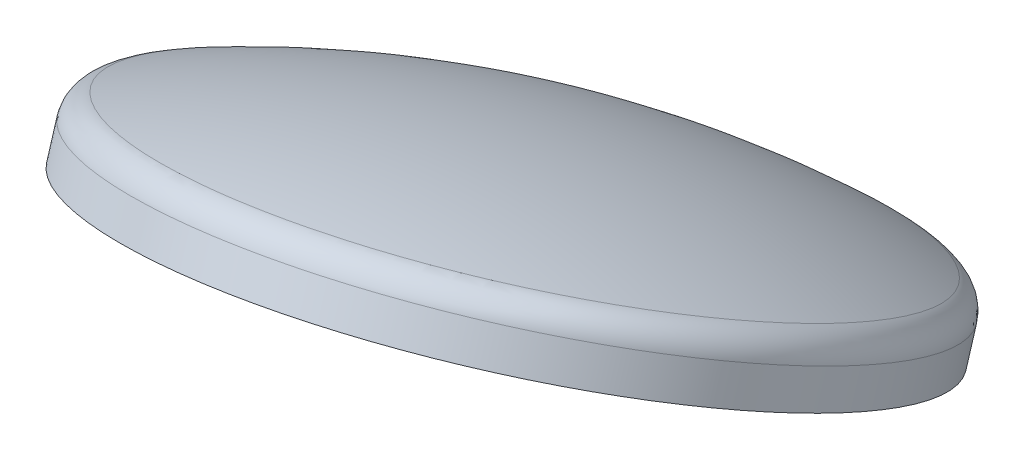
ISO-10303-21;
HEADER;
FILE_DESCRIPTION(('STEP AP214'),'2;1');
FILE_NAME('part.step','',(''),(''),'','','');
FILE_SCHEMA(('AUTOMOTIVE_DESIGN { 1 0 10303 214 1 1 1 1 }'));
ENDSEC;
DATA;
#1=APPLICATION_CONTEXT('core data for automotive mechanical design processes');
#2=APPLICATION_PROTOCOL_DEFINITION('international standard','automotive_design',2000,#1);
#3=PRODUCT_CONTEXT('',#1,'mechanical');
#4=PRODUCT('Part','Part','',(#3));
#5=PRODUCT_RELATED_PRODUCT_CATEGORY('part','',(#4));
#6=PRODUCT_DEFINITION_FORMATION('','',#4);
#7=PRODUCT_DEFINITION_CONTEXT('part definition',#1,'design');
#8=PRODUCT_DEFINITION('design','',#6,#7);
#9=PRODUCT_DEFINITION_SHAPE('','',#8);
#10=(LENGTH_UNIT() NAMED_UNIT(*) SI_UNIT(.MILLI.,.METRE.));
#11=(NAMED_UNIT(*) PLANE_ANGLE_UNIT() SI_UNIT($,.RADIAN.));
#12=(NAMED_UNIT(*) SI_UNIT($,.STERADIAN.) SOLID_ANGLE_UNIT());
#13=UNCERTAINTY_MEASURE_WITH_UNIT(LENGTH_MEASURE(1.E-05),#10,'distance_accuracy_value','');
#14=(GEOMETRIC_REPRESENTATION_CONTEXT(3) GLOBAL_UNCERTAINTY_ASSIGNED_CONTEXT((#13)) GLOBAL_UNIT_ASSIGNED_CONTEXT((#10,
#11,#12)) REPRESENTATION_CONTEXT('',''));
#15=CARTESIAN_POINT('',(0.,0.,0.));
#16=DIRECTION('',(0.,0.,1.));
#17=DIRECTION('',(1.,0.,0.));
#18=AXIS2_PLACEMENT_3D('',#15,#16,#17);
#19=CARTESIAN_POINT('',(-243.694534553083,114.821215464031,169.928663378537));
#20=DIRECTION('',(-0.106421938285636,0.905813628156302,-0.410092723780666));
#21=DIRECTION('',(0.,0.412434916783466,0.910987068743468));
#22=AXIS2_PLACEMENT_3D('',#19,#20,#21);
#23=PLANE('',#22);
#24=CARTESIAN_POINT('',(-215.087873043626,23.3383331040168,-39.5625393875644));
#25=DIRECTION('',(-0.106421938285636,0.905813628156302,-0.410092723780666));
#26=DIRECTION('',(0.,0.412434916783466,0.910987068743468));
#27=AXIS2_PLACEMENT_3D('',#24,#25,#26);
#28=CIRCLE('',#27,233.553000000001);
#29=CARTESIAN_POINT('',(-215.087873043626,119.663745223546,173.20122347868));
#30=VERTEX_POINT('',#29);
#31=EDGE_CURVE('E55',#30,#30,#28,.T.);
#32=ORIENTED_EDGE('',*,*,#31,.F.);
#33=EDGE_LOOP('',(#32));
#34=FACE_BOUND('',#33,.T.);
#35=CARTESIAN_POINT('',(-215.087873043626,23.3383331040168,-39.5625393875643));
#36=DIRECTION('',(-0.106421938285636,0.905813628156302,-0.410092723780666));
#37=DIRECTION('',(0.,0.412434916783466,0.910987068743468));
#38=AXIS2_PLACEMENT_3D('',#35,#36,#37);
#39=CIRCLE('',#38,230.378000000002);
#40=CARTESIAN_POINT('',(-215.087873043626,118.354264362759,170.30883953542));
#41=VERTEX_POINT('',#40);
#42=EDGE_CURVE('E10',#41,#41,#39,.T.);
#43=ORIENTED_EDGE('',*,*,#42,.T.);
#44=EDGE_LOOP('',(#43));
#45=FACE_BOUND('',#44,.T.);
#46=ADVANCED_FACE('F33',(#34,#45),#23,.F.);
#47=CARTESIAN_POINT('',(-223.535114395048,95.2372898389191,-72.1136493376528));
#48=DIRECTION('',(-0.106421938285636,0.905813628156302,-0.410092723780666));
#49=DIRECTION('',(0.,0.412434916783466,0.910987068743468));
#50=AXIS2_PLACEMENT_3D('',#47,#48,#49);
#51=CYLINDRICAL_SURFACE('',#50,230.378000000001);
#52=ORIENTED_EDGE('',*,*,#42,.F.);
#53=EDGE_LOOP('',(#52));
#54=FACE_BOUND('',#53,.T.);
#55=CARTESIAN_POINT('',(-217.463781122888,43.5609484041285,-48.7180070606124));
#56=DIRECTION('',(-0.106421938285636,0.905813628156302,-0.410092723780666));
#57=DIRECTION('',(0.,0.412434916783466,0.910987068743468));
#58=AXIS2_PLACEMENT_3D('',#55,#56,#57);
#59=CIRCLE('',#58,230.378000000001);
#60=CARTESIAN_POINT('',(-217.463781122888,138.57687966287,161.153371862371));
#61=VERTEX_POINT('',#60);
#62=EDGE_CURVE('E39',#61,#61,#59,.T.);
#63=ORIENTED_EDGE('',*,*,#62,.T.);
#64=EDGE_LOOP('',(#63));
#65=FACE_BOUND('',#64,.T.);
#66=ADVANCED_FACE('F62',(#54,#65),#51,.F.);
#67=CARTESIAN_POINT('',(-217.463781122888,43.5609484041281,-48.7180070606122));
#68=DIRECTION('',(-0.106421938285636,0.905813628156302,-0.410092723780666));
#69=DIRECTION('',(0.,0.412434916783466,0.910987068743468));
#70=AXIS2_PLACEMENT_3D('',#67,#68,#69);
#71=TOROIDAL_SURFACE('',#70,211.328000000001,19.05);
#72=ORIENTED_EDGE('',*,*,#62,.F.);
#73=EDGE_LOOP('',(#72));
#74=FACE_BOUND('',#73,.T.);
#75=CARTESIAN_POINT('',(-219.383922920314,59.9042948618149,-56.1171974196331));
#76=DIRECTION('',(-0.106421938285636,0.905813628156302,-0.410092723780666));
#77=DIRECTION('',(0.,0.412434916783466,0.910987068743468));
#78=AXIS2_PLACEMENT_3D('',#75,#76,#77);
#79=CIRCLE('',#78,217.440492459937);
#80=CARTESIAN_POINT('',(-219.383922920314,149.584346274885,141.968279432581));
#81=VERTEX_POINT('',#80);
#82=EDGE_CURVE('E43',#81,#81,#79,.T.);
#83=ORIENTED_EDGE('',*,*,#82,.T.);
#84=EDGE_LOOP('',(#83));
#85=FACE_BOUND('',#84,.T.);
#86=ADVANCED_FACE('F66',(#74,#85),#71,.F.);
#87=CARTESIAN_POINT('',(-151.078468024181,-521.4797028274,207.095167424291));
#88=DIRECTION('',(-0.106421938285636,0.905813628156302,-0.410092723780666));
#89=DIRECTION('',(0.124172714015471,-0.397099038797168,-0.909336841044284));
#90=AXIS2_PLACEMENT_3D('',#87,#88,#89);
#91=SPHERICAL_SURFACE('',#90,677.668137590668);
#92=ORIENTED_EDGE('',*,*,#82,.F.);
#93=EDGE_LOOP('',(#92));
#94=FACE_BOUND('',#93,.T.);
#95=ADVANCED_FACE('F71',(#94),#91,.F.);
#96=CARTESIAN_POINT('',(-151.078468024181,-521.4797028274,207.095167424291));
#97=DIRECTION('',(-0.106421938285636,0.905813628156302,-0.410092723780666));
#98=DIRECTION('',(-0.124172714015471,0.397099038797168,0.909336841044284));
#99=AXIS2_PLACEMENT_3D('',#96,#97,#98);
#100=SPHERICAL_SURFACE('',#99,680.843137590668);
#101=CARTESIAN_POINT('',(-219.623515171074,61.9435917345788,-57.0404566676215));
#102=DIRECTION('',(-0.106421938285636,0.905813628156302,-0.410092723780666));
#103=DIRECTION('',(0.,0.412434916783466,0.910987068743468));
#104=AXIS2_PLACEMENT_3D('',#101,#102,#103);
#105=CIRCLE('',#104,220.677561079428);
#106=CARTESIAN_POINT('',(-219.623515171074,152.958723274351,143.993947837585));
#107=VERTEX_POINT('',#106);
#108=EDGE_CURVE('E47',#107,#107,#105,.T.);
#109=ORIENTED_EDGE('',*,*,#108,.T.);
#110=EDGE_LOOP('',(#109));
#111=FACE_BOUND('',#110,.T.);
#112=ADVANCED_FACE('F77',(#111),#100,.T.);
#113=CARTESIAN_POINT('',(-217.705623844785,45.6194002317661,-49.6499384099843));
#114=DIRECTION('',(-0.106421938285636,0.905813628156302,-0.410092723780666));
#115=DIRECTION('',(0.,0.412434916783466,0.910987068743468));
#116=AXIS2_PLACEMENT_3D('',#113,#114,#115);
#117=TOROIDAL_SURFACE('',#116,214.503000000001,19.0500000000001);
#118=ORIENTED_EDGE('',*,*,#108,.F.);
#119=EDGE_LOOP('',(#118));
#120=FACE_BOUND('',#119,.T.);
#121=CARTESIAN_POINT('',(-217.705623844785,45.6194002317664,-49.6499384099845));
#122=DIRECTION('',(-0.106421938285636,0.905813628156302,-0.410092723780666));
#123=DIRECTION('',(0.,0.412434916783466,0.910987068743468));
#124=AXIS2_PLACEMENT_3D('',#121,#122,#123);
#125=CIRCLE('',#124,233.553000000001);
#126=CARTESIAN_POINT('',(-217.705623844785,141.944812351296,163.11382445626));
#127=VERTEX_POINT('',#126);
#128=EDGE_CURVE('E52',#127,#127,#125,.T.);
#129=ORIENTED_EDGE('',*,*,#128,.T.);
#130=EDGE_LOOP('',(#129));
#131=FACE_BOUND('',#130,.T.);
#132=ADVANCED_FACE('F81',(#120,#131),#117,.T.);
#133=CARTESIAN_POINT('',(-223.535114395048,95.2372898389191,-72.1136493376528));
#134=DIRECTION('',(-0.106421938285636,0.905813628156302,-0.410092723780666));
#135=DIRECTION('',(0.,0.412434916783466,0.910987068743468));
#136=AXIS2_PLACEMENT_3D('',#133,#134,#135);
#137=CYLINDRICAL_SURFACE('',#136,233.553000000001);
#138=ORIENTED_EDGE('',*,*,#128,.F.);
#139=EDGE_LOOP('',(#138));
#140=FACE_BOUND('',#139,.T.);
#141=ORIENTED_EDGE('',*,*,#31,.T.);
#142=EDGE_LOOP('',(#141));
#143=FACE_BOUND('',#142,.T.);
#144=ADVANCED_FACE('F59',(#140,#143),#137,.T.);
#145=CLOSED_SHELL('',(#46,#66,#86,#95,#112,#132,#144));
#146=MANIFOLD_SOLID_BREP('B2',#145);
#147=ADVANCED_BREP_SHAPE_REPRESENTATION('',(#18,#146),#14);
#148=SHAPE_DEFINITION_REPRESENTATION(#9,#147);
ENDSEC;
END-ISO-10303-21;
